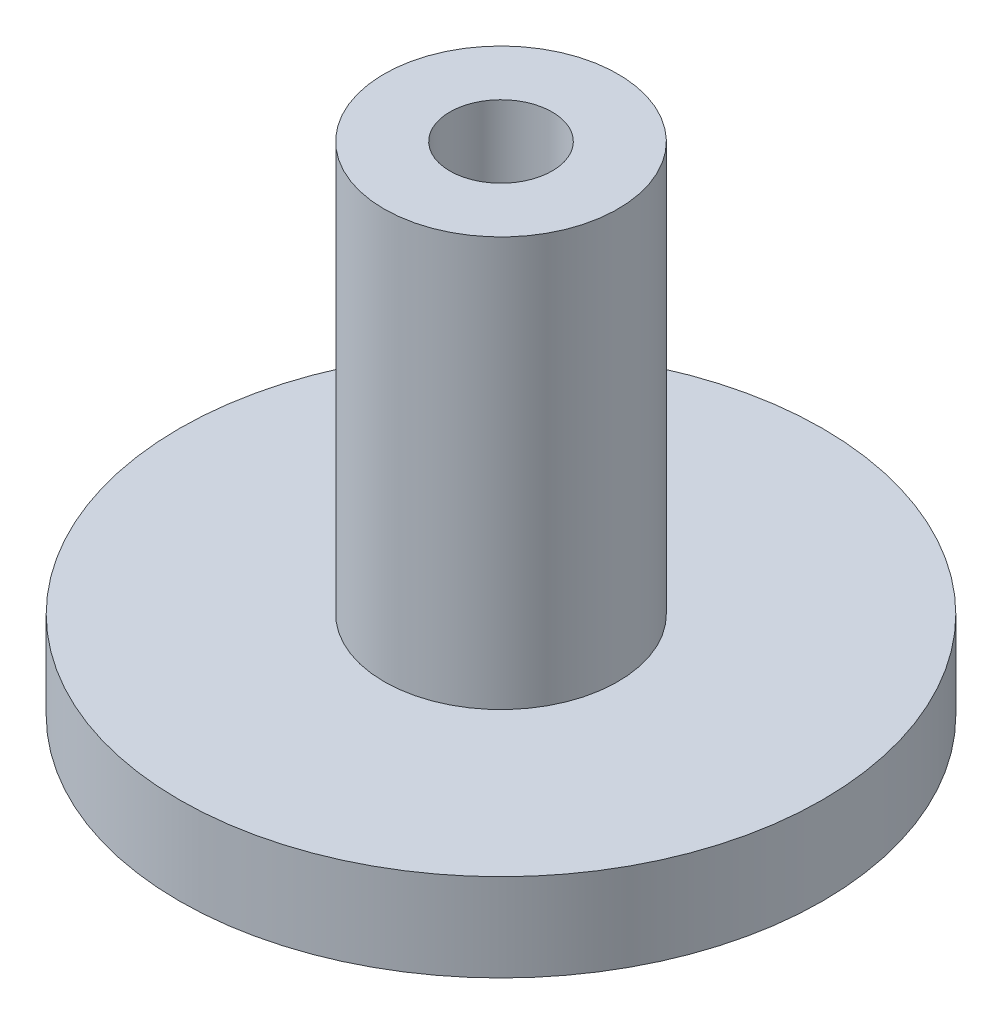
ISO-10303-21;
HEADER;
FILE_DESCRIPTION(('STEP AP214'),'2;1');
FILE_NAME('part.step','',(''),(''),'','','');
FILE_SCHEMA(('AUTOMOTIVE_DESIGN { 1 0 10303 214 1 1 1 1 }'));
ENDSEC;
DATA;
#1=APPLICATION_CONTEXT('core data for automotive mechanical design processes');
#2=APPLICATION_PROTOCOL_DEFINITION('international standard','automotive_design',2000,#1);
#3=PRODUCT_CONTEXT('',#1,'mechanical');
#4=PRODUCT('Part','Part','',(#3));
#5=PRODUCT_RELATED_PRODUCT_CATEGORY('part','',(#4));
#6=PRODUCT_DEFINITION_FORMATION('','',#4);
#7=PRODUCT_DEFINITION_CONTEXT('part definition',#1,'design');
#8=PRODUCT_DEFINITION('design','',#6,#7);
#9=PRODUCT_DEFINITION_SHAPE('','',#8);
#10=(LENGTH_UNIT() NAMED_UNIT(*) SI_UNIT(.MILLI.,.METRE.));
#11=(NAMED_UNIT(*) PLANE_ANGLE_UNIT() SI_UNIT($,.RADIAN.));
#12=(NAMED_UNIT(*) SI_UNIT($,.STERADIAN.) SOLID_ANGLE_UNIT());
#13=UNCERTAINTY_MEASURE_WITH_UNIT(LENGTH_MEASURE(1.E-05),#10,'distance_accuracy_value','');
#14=(GEOMETRIC_REPRESENTATION_CONTEXT(3) GLOBAL_UNCERTAINTY_ASSIGNED_CONTEXT((#13)) GLOBAL_UNIT_ASSIGNED_CONTEXT((#10,
#11,#12)) REPRESENTATION_CONTEXT('',''));
#15=CARTESIAN_POINT('',(0.,0.,0.));
#16=DIRECTION('',(0.,0.,1.));
#17=DIRECTION('',(1.,0.,0.));
#18=AXIS2_PLACEMENT_3D('',#15,#16,#17);
#19=CARTESIAN_POINT('',(0.,3.,0.));
#20=DIRECTION('',(0.,-1.,0.));
#21=DIRECTION('',(0.,0.,-1.));
#22=AXIS2_PLACEMENT_3D('',#19,#20,#21);
#23=CYLINDRICAL_SURFACE('',#22,11.);
#24=CARTESIAN_POINT('',(0.,3.,0.));
#25=DIRECTION('',(0.,1.,0.));
#26=DIRECTION('',(0.,0.,1.));
#27=AXIS2_PLACEMENT_3D('',#24,#25,#26);
#28=CIRCLE('',#27,11.);
#29=CARTESIAN_POINT('',(0.,3.,11.));
#30=VERTEX_POINT('',#29);
#31=EDGE_CURVE('E51',#30,#30,#28,.T.);
#32=ORIENTED_EDGE('',*,*,#31,.F.);
#33=EDGE_LOOP('',(#32));
#34=FACE_BOUND('',#33,.T.);
#35=CARTESIAN_POINT('',(0.,0.,0.));
#36=DIRECTION('',(0.,1.,0.));
#37=DIRECTION('',(0.,0.,1.));
#38=AXIS2_PLACEMENT_3D('',#35,#36,#37);
#39=CIRCLE('',#38,11.);
#40=CARTESIAN_POINT('',(0.,0.,11.));
#41=VERTEX_POINT('',#40);
#42=EDGE_CURVE('E46',#41,#41,#39,.T.);
#43=ORIENTED_EDGE('',*,*,#42,.T.);
#44=EDGE_LOOP('',(#43));
#45=FACE_BOUND('',#44,.T.);
#46=ADVANCED_FACE('F43',(#34,#45),#23,.T.);
#47=CARTESIAN_POINT('',(0.,3.,0.));
#48=DIRECTION('',(0.,1.,0.));
#49=DIRECTION('',(0.,0.,1.));
#50=AXIS2_PLACEMENT_3D('',#47,#48,#49);
#51=PLANE('',#50);
#52=CARTESIAN_POINT('',(0.,3.,0.));
#53=DIRECTION('',(0.,1.,0.));
#54=DIRECTION('',(0.,0.,1.));
#55=AXIS2_PLACEMENT_3D('',#52,#53,#54);
#56=CIRCLE('',#55,4.);
#57=CARTESIAN_POINT('',(0.,3.,4.));
#58=VERTEX_POINT('',#57);
#59=EDGE_CURVE('E10',#58,#58,#56,.T.);
#60=ORIENTED_EDGE('',*,*,#59,.F.);
#61=EDGE_LOOP('',(#60));
#62=FACE_BOUND('',#61,.T.);
#63=ORIENTED_EDGE('',*,*,#31,.T.);
#64=EDGE_LOOP('',(#63));
#65=FACE_BOUND('',#64,.T.);
#66=ADVANCED_FACE('F88',(#62,#65),#51,.T.);
#67=CARTESIAN_POINT('',(0.,0.,0.));
#68=DIRECTION('',(0.,1.,0.));
#69=DIRECTION('',(0.,0.,1.));
#70=AXIS2_PLACEMENT_3D('',#67,#68,#69);
#71=PLANE('',#70);
#72=CARTESIAN_POINT('',(0.,0.,0.));
#73=DIRECTION('',(0.,1.,0.));
#74=DIRECTION('',(0.,0.,1.));
#75=AXIS2_PLACEMENT_3D('',#72,#73,#74);
#76=CIRCLE('',#75,1.75);
#77=CARTESIAN_POINT('',(0.,0.,1.75));
#78=VERTEX_POINT('',#77);
#79=EDGE_CURVE('E62',#78,#78,#76,.T.);
#80=ORIENTED_EDGE('',*,*,#79,.T.);
#81=EDGE_LOOP('',(#80));
#82=FACE_BOUND('',#81,.T.);
#83=ORIENTED_EDGE('',*,*,#42,.F.);
#84=EDGE_LOOP('',(#83));
#85=FACE_BOUND('',#84,.T.);
#86=ADVANCED_FACE('F82',(#82,#85),#71,.F.);
#87=CARTESIAN_POINT('',(0.,17.,0.));
#88=DIRECTION('',(0.,-1.,0.));
#89=DIRECTION('',(0.,0.,-1.));
#90=AXIS2_PLACEMENT_3D('',#87,#88,#89);
#91=CYLINDRICAL_SURFACE('',#90,4.);
#92=CARTESIAN_POINT('',(0.,17.,0.));
#93=DIRECTION('',(0.,1.,0.));
#94=DIRECTION('',(0.,0.,1.));
#95=AXIS2_PLACEMENT_3D('',#92,#93,#94);
#96=CIRCLE('',#95,4.);
#97=CARTESIAN_POINT('',(0.,17.,4.));
#98=VERTEX_POINT('',#97);
#99=EDGE_CURVE('E58',#98,#98,#96,.T.);
#100=ORIENTED_EDGE('',*,*,#99,.F.);
#101=EDGE_LOOP('',(#100));
#102=FACE_BOUND('',#101,.T.);
#103=ORIENTED_EDGE('',*,*,#59,.T.);
#104=EDGE_LOOP('',(#103));
#105=FACE_BOUND('',#104,.T.);
#106=ADVANCED_FACE('F77',(#102,#105),#91,.T.);
#107=CARTESIAN_POINT('',(0.,17.,0.));
#108=DIRECTION('',(0.,1.,0.));
#109=DIRECTION('',(0.,0.,1.));
#110=AXIS2_PLACEMENT_3D('',#107,#108,#109);
#111=PLANE('',#110);
#112=CARTESIAN_POINT('',(0.,17.,0.));
#113=DIRECTION('',(0.,1.,0.));
#114=DIRECTION('',(0.,0.,1.));
#115=AXIS2_PLACEMENT_3D('',#112,#113,#114);
#116=CIRCLE('',#115,1.75);
#117=CARTESIAN_POINT('',(0.,17.,1.75));
#118=VERTEX_POINT('',#117);
#119=EDGE_CURVE('E66',#118,#118,#116,.T.);
#120=ORIENTED_EDGE('',*,*,#119,.F.);
#121=EDGE_LOOP('',(#120));
#122=FACE_BOUND('',#121,.T.);
#123=ORIENTED_EDGE('',*,*,#99,.T.);
#124=EDGE_LOOP('',(#123));
#125=FACE_BOUND('',#124,.T.);
#126=ADVANCED_FACE('F74',(#122,#125),#111,.T.);
#127=CARTESIAN_POINT('',(0.,-3.,0.));
#128=DIRECTION('',(0.,1.,0.));
#129=DIRECTION('',(0.,0.,1.));
#130=AXIS2_PLACEMENT_3D('',#127,#128,#129);
#131=CYLINDRICAL_SURFACE('',#130,1.75);
#132=ORIENTED_EDGE('',*,*,#119,.T.);
#133=EDGE_LOOP('',(#132));
#134=FACE_BOUND('',#133,.T.);
#135=ORIENTED_EDGE('',*,*,#79,.F.);
#136=EDGE_LOOP('',(#135));
#137=FACE_BOUND('',#136,.T.);
#138=ADVANCED_FACE('F71',(#134,#137),#131,.F.);
#139=CLOSED_SHELL('',(#46,#66,#86,#106,#126,#138));
#140=MANIFOLD_SOLID_BREP('B2',#139);
#141=ADVANCED_BREP_SHAPE_REPRESENTATION('',(#18,#140),#14);
#142=SHAPE_DEFINITION_REPRESENTATION(#9,#141);
ENDSEC;
END-ISO-10303-21;
